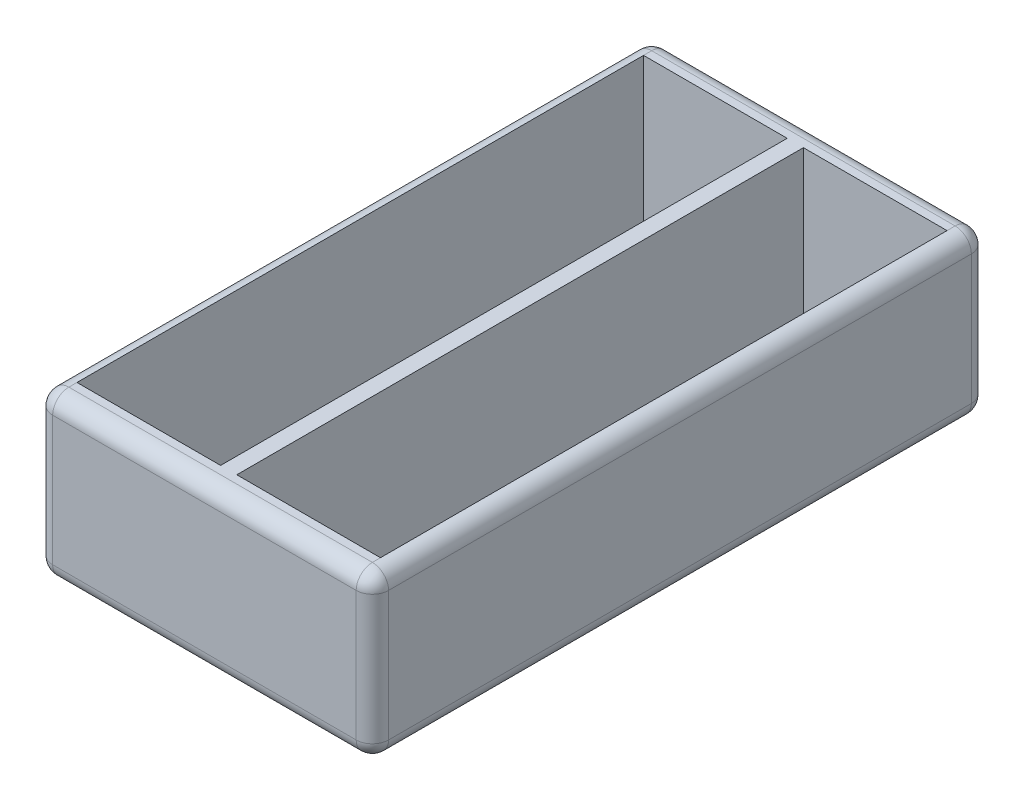
ISO-10303-21;
HEADER;
FILE_DESCRIPTION(('STEP AP214'),'2;1');
FILE_NAME('part.step','',(''),(''),'','','');
FILE_SCHEMA(('AUTOMOTIVE_DESIGN { 1 0 10303 214 1 1 1 1 }'));
ENDSEC;
DATA;
#1=APPLICATION_CONTEXT('core data for automotive mechanical design processes');
#2=APPLICATION_PROTOCOL_DEFINITION('international standard','automotive_design',2000,#1);
#3=PRODUCT_CONTEXT('',#1,'mechanical');
#4=PRODUCT('Part','Part','',(#3));
#5=PRODUCT_RELATED_PRODUCT_CATEGORY('part','',(#4));
#6=PRODUCT_DEFINITION_FORMATION('','',#4);
#7=PRODUCT_DEFINITION_CONTEXT('part definition',#1,'design');
#8=PRODUCT_DEFINITION('design','',#6,#7);
#9=PRODUCT_DEFINITION_SHAPE('','',#8);
#10=(LENGTH_UNIT() NAMED_UNIT(*) SI_UNIT(.MILLI.,.METRE.));
#11=(NAMED_UNIT(*) PLANE_ANGLE_UNIT() SI_UNIT($,.RADIAN.));
#12=(NAMED_UNIT(*) SI_UNIT($,.STERADIAN.) SOLID_ANGLE_UNIT());
#13=UNCERTAINTY_MEASURE_WITH_UNIT(LENGTH_MEASURE(1.E-05),#10,'distance_accuracy_value','');
#14=(GEOMETRIC_REPRESENTATION_CONTEXT(3) GLOBAL_UNCERTAINTY_ASSIGNED_CONTEXT((#13)) GLOBAL_UNIT_ASSIGNED_CONTEXT((#10,
#11,#12)) REPRESENTATION_CONTEXT('',''));
#15=CARTESIAN_POINT('',(0.,0.,0.));
#16=DIRECTION('',(0.,0.,1.));
#17=DIRECTION('',(1.,0.,0.));
#18=AXIS2_PLACEMENT_3D('',#15,#16,#17);
#19=CARTESIAN_POINT('',(20.75,20.,38.));
#20=DIRECTION('',(-1.,0.,0.));
#21=DIRECTION('',(0.,0.,1.));
#22=AXIS2_PLACEMENT_3D('',#19,#20,#21);
#23=PLANE('',#22);
#24=DIRECTION('',(0.,0.,-1.));
#25=VECTOR('',#24,1.);
#26=CARTESIAN_POINT('',(20.75,2.,-38.));
#27=LINE('',#26,#25);
#28=CARTESIAN_POINT('',(20.75,2.,36.));
#29=VERTEX_POINT('',#28);
#30=CARTESIAN_POINT('',(20.75,2.,-36.));
#31=VERTEX_POINT('',#30);
#32=EDGE_CURVE('E64',#29,#31,#27,.T.);
#33=ORIENTED_EDGE('',*,*,#32,.T.);
#34=DIRECTION('',(0.,-1.,0.));
#35=VECTOR('',#34,1.);
#36=CARTESIAN_POINT('',(20.75,20.,-36.));
#37=LINE('',#36,#35);
#38=CARTESIAN_POINT('',(20.75,18.,-36.));
#39=VERTEX_POINT('',#38);
#40=EDGE_CURVE('E11',#31,#39,#37,.F.);
#41=ORIENTED_EDGE('',*,*,#40,.T.);
#42=DIRECTION('',(0.,0.,-1.));
#43=VECTOR('',#42,1.);
#44=CARTESIAN_POINT('',(20.75,18.,38.));
#45=LINE('',#44,#43);
#46=CARTESIAN_POINT('',(20.75,18.,36.));
#47=VERTEX_POINT('',#46);
#48=EDGE_CURVE('E49',#39,#47,#45,.F.);
#49=ORIENTED_EDGE('',*,*,#48,.T.);
#50=DIRECTION('',(0.,-1.,0.));
#51=VECTOR('',#50,1.);
#52=CARTESIAN_POINT('',(20.75,20.,36.));
#53=LINE('',#52,#51);
#54=EDGE_CURVE('E355',#47,#29,#53,.T.);
#55=ORIENTED_EDGE('',*,*,#54,.T.);
#56=EDGE_LOOP('',(#33,#41,#49,#55));
#57=FACE_BOUND('',#56,.T.);
#58=ADVANCED_FACE('F39',(#57),#23,.F.);
#59=CARTESIAN_POINT('',(-20.75,20.,-38.));
#60=DIRECTION('',(0.,0.,1.));
#61=DIRECTION('',(1.,0.,0.));
#62=AXIS2_PLACEMENT_3D('',#59,#60,#61);
#63=PLANE('',#62);
#64=DIRECTION('',(-1.,0.,0.));
#65=VECTOR('',#64,1.);
#66=CARTESIAN_POINT('',(-20.75,18.,-38.));
#67=LINE('',#66,#65);
#68=CARTESIAN_POINT('',(-18.75,18.,-38.));
#69=VERTEX_POINT('',#68);
#70=CARTESIAN_POINT('',(18.75,18.,-38.));
#71=VERTEX_POINT('',#70);
#72=EDGE_CURVE('E348',#69,#71,#67,.F.);
#73=ORIENTED_EDGE('',*,*,#72,.T.);
#74=DIRECTION('',(0.,-1.,0.));
#75=VECTOR('',#74,1.);
#76=CARTESIAN_POINT('',(18.75,20.,-38.));
#77=LINE('',#76,#75);
#78=CARTESIAN_POINT('',(18.75,2.,-38.));
#79=VERTEX_POINT('',#78);
#80=EDGE_CURVE('E351',#71,#79,#77,.T.);
#81=ORIENTED_EDGE('',*,*,#80,.T.);
#82=DIRECTION('',(-1.,0.,0.));
#83=VECTOR('',#82,1.);
#84=CARTESIAN_POINT('',(-20.75,2.,-38.));
#85=LINE('',#84,#83);
#86=CARTESIAN_POINT('',(-18.75,2.,-38.));
#87=VERTEX_POINT('',#86);
#88=EDGE_CURVE('E342',#79,#87,#85,.T.);
#89=ORIENTED_EDGE('',*,*,#88,.T.);
#90=DIRECTION('',(0.,-1.,0.));
#91=VECTOR('',#90,1.);
#92=CARTESIAN_POINT('',(-18.75,20.,-38.));
#93=LINE('',#92,#91);
#94=EDGE_CURVE('E345',#87,#69,#93,.F.);
#95=ORIENTED_EDGE('',*,*,#94,.T.);
#96=EDGE_LOOP('',(#73,#81,#89,#95));
#97=FACE_BOUND('',#96,.T.);
#98=ADVANCED_FACE('F495',(#97),#63,.F.);
#99=CARTESIAN_POINT('',(-20.75,20.,38.));
#100=DIRECTION('',(1.,0.,0.));
#101=DIRECTION('',(0.,0.,-1.));
#102=AXIS2_PLACEMENT_3D('',#99,#100,#101);
#103=PLANE('',#102);
#104=DIRECTION('',(0.,-1.,0.));
#105=VECTOR('',#104,1.);
#106=CARTESIAN_POINT('',(-20.75,20.,36.));
#107=LINE('',#106,#105);
#108=CARTESIAN_POINT('',(-20.75,2.,36.));
#109=VERTEX_POINT('',#108);
#110=CARTESIAN_POINT('',(-20.75,18.,36.));
#111=VERTEX_POINT('',#110);
#112=EDGE_CURVE('E309',#109,#111,#107,.F.);
#113=ORIENTED_EDGE('',*,*,#112,.T.);
#114=DIRECTION('',(0.,0.,1.));
#115=VECTOR('',#114,1.);
#116=CARTESIAN_POINT('',(-20.75,18.,38.));
#117=LINE('',#116,#115);
#118=CARTESIAN_POINT('',(-20.75,18.,-36.));
#119=VERTEX_POINT('',#118);
#120=EDGE_CURVE('E312',#111,#119,#117,.F.);
#121=ORIENTED_EDGE('',*,*,#120,.T.);
#122=DIRECTION('',(0.,-1.,0.));
#123=VECTOR('',#122,1.);
#124=CARTESIAN_POINT('',(-20.75,20.,-36.));
#125=LINE('',#124,#123);
#126=CARTESIAN_POINT('',(-20.75,2.,-36.));
#127=VERTEX_POINT('',#126);
#128=EDGE_CURVE('E303',#119,#127,#125,.T.);
#129=ORIENTED_EDGE('',*,*,#128,.T.);
#130=DIRECTION('',(0.,0.,1.));
#131=VECTOR('',#130,1.);
#132=CARTESIAN_POINT('',(-20.75,2.,38.));
#133=LINE('',#132,#131);
#134=EDGE_CURVE('E306',#127,#109,#133,.T.);
#135=ORIENTED_EDGE('',*,*,#134,.T.);
#136=EDGE_LOOP('',(#113,#121,#129,#135));
#137=FACE_BOUND('',#136,.T.);
#138=ADVANCED_FACE('F500',(#137),#103,.F.);
#139=CARTESIAN_POINT('',(-20.75,20.,38.));
#140=DIRECTION('',(0.,0.,-1.));
#141=DIRECTION('',(-1.,0.,0.));
#142=AXIS2_PLACEMENT_3D('',#139,#140,#141);
#143=PLANE('',#142);
#144=DIRECTION('',(1.,0.,0.));
#145=VECTOR('',#144,1.);
#146=CARTESIAN_POINT('',(-20.75,18.,38.));
#147=LINE('',#146,#145);
#148=CARTESIAN_POINT('',(18.75,18.,38.));
#149=VERTEX_POINT('',#148);
#150=CARTESIAN_POINT('',(-18.75,18.,38.));
#151=VERTEX_POINT('',#150);
#152=EDGE_CURVE('E316',#149,#151,#147,.F.);
#153=ORIENTED_EDGE('',*,*,#152,.T.);
#154=DIRECTION('',(0.,-1.,0.));
#155=VECTOR('',#154,1.);
#156=CARTESIAN_POINT('',(-18.75,20.,38.));
#157=LINE('',#156,#155);
#158=CARTESIAN_POINT('',(-18.75,2.,38.));
#159=VERTEX_POINT('',#158);
#160=EDGE_CURVE('E325',#151,#159,#157,.T.);
#161=ORIENTED_EDGE('',*,*,#160,.T.);
#162=DIRECTION('',(1.,0.,0.));
#163=VECTOR('',#162,1.);
#164=CARTESIAN_POINT('',(20.75,2.,38.));
#165=LINE('',#164,#163);
#166=CARTESIAN_POINT('',(18.75,2.,38.));
#167=VERTEX_POINT('',#166);
#168=EDGE_CURVE('E322',#159,#167,#165,.T.);
#169=ORIENTED_EDGE('',*,*,#168,.T.);
#170=DIRECTION('',(0.,-1.,0.));
#171=VECTOR('',#170,1.);
#172=CARTESIAN_POINT('',(18.75,20.,38.));
#173=LINE('',#172,#171);
#174=EDGE_CURVE('E319',#167,#149,#173,.F.);
#175=ORIENTED_EDGE('',*,*,#174,.T.);
#176=EDGE_LOOP('',(#153,#161,#169,#175));
#177=FACE_BOUND('',#176,.T.);
#178=ADVANCED_FACE('F489',(#177),#143,.F.);
#179=CARTESIAN_POINT('',(0.,20.,0.));
#180=DIRECTION('',(0.,-1.,0.));
#181=DIRECTION('',(0.,0.,-1.));
#182=AXIS2_PLACEMENT_3D('',#179,#180,#181);
#183=PLANE('',#182);
#184=DIRECTION('',(-1.,0.,0.));
#185=VECTOR('',#184,1.);
#186=CARTESIAN_POINT('',(0.,20.,-36.));
#187=LINE('',#186,#185);
#188=CARTESIAN_POINT('',(18.75,20.,-36.));
#189=VERTEX_POINT('',#188);
#190=CARTESIAN_POINT('',(-18.75,20.,-36.));
#191=VERTEX_POINT('',#190);
#192=EDGE_CURVE('E296',#189,#191,#187,.T.);
#193=ORIENTED_EDGE('',*,*,#192,.T.);
#194=DIRECTION('',(0.,0.,1.));
#195=VECTOR('',#194,1.);
#196=CARTESIAN_POINT('',(-18.75,20.,0.));
#197=LINE('',#196,#195);
#198=CARTESIAN_POINT('',(-18.75,20.,-35.));
#199=VERTEX_POINT('',#198);
#200=EDGE_CURVE('E299',#191,#199,#197,.T.);
#201=ORIENTED_EDGE('',*,*,#200,.T.);
#202=DIRECTION('',(-1.,0.,0.));
#203=VECTOR('',#202,1.);
#204=CARTESIAN_POINT('',(-0.999999999999999,20.,-35.));
#205=LINE('',#204,#203);
#206=CARTESIAN_POINT('',(-0.999999999999999,20.,-35.));
#207=VERTEX_POINT('',#206);
#208=EDGE_CURVE('E225',#207,#199,#205,.T.);
#209=ORIENTED_EDGE('',*,*,#208,.F.);
#210=DIRECTION('',(0.,0.,-1.));
#211=VECTOR('',#210,1.);
#212=CARTESIAN_POINT('',(-0.999999999999999,20.,-35.));
#213=LINE('',#212,#211);
#214=CARTESIAN_POINT('',(-0.99999999999999,20.,35.));
#215=VERTEX_POINT('',#214);
#216=EDGE_CURVE('E188',#215,#207,#213,.T.);
#217=ORIENTED_EDGE('',*,*,#216,.F.);
#218=DIRECTION('',(1.,0.,0.));
#219=VECTOR('',#218,1.);
#220=CARTESIAN_POINT('',(-0.99999999999999,20.,35.));
#221=LINE('',#220,#219);
#222=CARTESIAN_POINT('',(-18.75,20.,35.));
#223=VERTEX_POINT('',#222);
#224=EDGE_CURVE('E209',#223,#215,#221,.T.);
#225=ORIENTED_EDGE('',*,*,#224,.F.);
#226=DIRECTION('',(0.,0.,1.));
#227=VECTOR('',#226,1.);
#228=CARTESIAN_POINT('',(-18.75,20.,0.));
#229=LINE('',#228,#227);
#230=CARTESIAN_POINT('',(-18.75,20.,36.));
#231=VERTEX_POINT('',#230);
#232=EDGE_CURVE('E290',#223,#231,#229,.T.);
#233=ORIENTED_EDGE('',*,*,#232,.T.);
#234=DIRECTION('',(1.,0.,0.));
#235=VECTOR('',#234,1.);
#236=CARTESIAN_POINT('',(0.,20.,36.));
#237=LINE('',#236,#235);
#238=CARTESIAN_POINT('',(18.75,20.,36.));
#239=VERTEX_POINT('',#238);
#240=EDGE_CURVE('E235',#231,#239,#237,.T.);
#241=ORIENTED_EDGE('',*,*,#240,.T.);
#242=DIRECTION('',(0.,0.,-1.));
#243=VECTOR('',#242,1.);
#244=CARTESIAN_POINT('',(18.75,20.,0.));
#245=LINE('',#244,#243);
#246=CARTESIAN_POINT('',(18.75,20.,35.));
#247=VERTEX_POINT('',#246);
#248=EDGE_CURVE('E287',#239,#247,#245,.T.);
#249=ORIENTED_EDGE('',*,*,#248,.T.);
#250=DIRECTION('',(1.,0.,0.));
#251=VECTOR('',#250,1.);
#252=CARTESIAN_POINT('',(0.99999999999999,20.,35.));
#253=LINE('',#252,#251);
#254=CARTESIAN_POINT('',(0.99999999999999,20.,35.));
#255=VERTEX_POINT('',#254);
#256=EDGE_CURVE('E266',#255,#247,#253,.T.);
#257=ORIENTED_EDGE('',*,*,#256,.F.);
#258=DIRECTION('',(0.,0.,1.));
#259=VECTOR('',#258,1.);
#260=CARTESIAN_POINT('',(0.999999999999999,20.,-35.));
#261=LINE('',#260,#259);
#262=CARTESIAN_POINT('',(0.999999999999999,20.,-35.));
#263=VERTEX_POINT('',#262);
#264=EDGE_CURVE('E262',#263,#255,#261,.T.);
#265=ORIENTED_EDGE('',*,*,#264,.F.);
#266=DIRECTION('',(-1.,0.,0.));
#267=VECTOR('',#266,1.);
#268=CARTESIAN_POINT('',(0.999999999999999,20.,-35.));
#269=LINE('',#268,#267);
#270=CARTESIAN_POINT('',(18.75,20.,-35.));
#271=VERTEX_POINT('',#270);
#272=EDGE_CURVE('E259',#271,#263,#269,.T.);
#273=ORIENTED_EDGE('',*,*,#272,.F.);
#274=DIRECTION('',(0.,0.,-1.));
#275=VECTOR('',#274,1.);
#276=CARTESIAN_POINT('',(18.75,20.,0.));
#277=LINE('',#276,#275);
#278=EDGE_CURVE('E293',#271,#189,#277,.T.);
#279=ORIENTED_EDGE('',*,*,#278,.T.);
#280=EDGE_LOOP('',(#193,#201,#209,#217,#225,#233,#241,#249,#257,#265,#273,#279));
#281=FACE_BOUND('',#280,.T.);
#282=ADVANCED_FACE('F479',(#281),#183,.F.);
#283=CARTESIAN_POINT('',(0.,0.,0.));
#284=DIRECTION('',(0.,-1.,0.));
#285=DIRECTION('',(0.,0.,-1.));
#286=AXIS2_PLACEMENT_3D('',#283,#284,#285);
#287=PLANE('',#286);
#288=DIRECTION('',(1.,0.,0.));
#289=VECTOR('',#288,1.);
#290=CARTESIAN_POINT('',(-20.75,0.,36.));
#291=LINE('',#290,#289);
#292=CARTESIAN_POINT('',(18.75,0.,36.));
#293=VERTEX_POINT('',#292);
#294=CARTESIAN_POINT('',(-18.75,0.,36.));
#295=VERTEX_POINT('',#294);
#296=EDGE_CURVE('E329',#293,#295,#291,.F.);
#297=ORIENTED_EDGE('',*,*,#296,.T.);
#298=DIRECTION('',(0.,0.,1.));
#299=VECTOR('',#298,1.);
#300=CARTESIAN_POINT('',(-18.75,0.,-38.));
#301=LINE('',#300,#299);
#302=CARTESIAN_POINT('',(-18.75,0.,-36.));
#303=VERTEX_POINT('',#302);
#304=EDGE_CURVE('E338',#295,#303,#301,.F.);
#305=ORIENTED_EDGE('',*,*,#304,.T.);
#306=DIRECTION('',(-1.,0.,0.));
#307=VECTOR('',#306,1.);
#308=CARTESIAN_POINT('',(20.75,0.,-36.));
#309=LINE('',#308,#307);
#310=CARTESIAN_POINT('',(18.75,0.,-36.));
#311=VERTEX_POINT('',#310);
#312=EDGE_CURVE('E335',#303,#311,#309,.F.);
#313=ORIENTED_EDGE('',*,*,#312,.T.);
#314=DIRECTION('',(0.,0.,-1.));
#315=VECTOR('',#314,1.);
#316=CARTESIAN_POINT('',(18.75,0.,38.));
#317=LINE('',#316,#315);
#318=EDGE_CURVE('E332',#311,#293,#317,.F.);
#319=ORIENTED_EDGE('',*,*,#318,.T.);
#320=EDGE_LOOP('',(#297,#305,#313,#319));
#321=FACE_BOUND('',#320,.T.);
#322=CARTESIAN_POINT('',(-8.85,0.,0.));
#323=DIRECTION('',(0.,-1.,0.));
#324=DIRECTION('',(0.,0.,-1.));
#325=AXIS2_PLACEMENT_3D('',#322,#323,#324);
#326=CIRCLE('',#325,1.6);
#327=CARTESIAN_POINT('',(-8.85,0.,-1.6));
#328=VERTEX_POINT('',#327);
#329=EDGE_CURVE('E464',#328,#328,#326,.T.);
#330=ORIENTED_EDGE('',*,*,#329,.F.);
#331=EDGE_LOOP('',(#330));
#332=FACE_BOUND('',#331,.T.);
#333=CARTESIAN_POINT('',(8.85,0.,0.));
#334=DIRECTION('',(0.,-1.,0.));
#335=DIRECTION('',(0.,0.,-1.));
#336=AXIS2_PLACEMENT_3D('',#333,#334,#335);
#337=CIRCLE('',#336,1.6);
#338=CARTESIAN_POINT('',(8.85,0.,-1.6));
#339=VERTEX_POINT('',#338);
#340=EDGE_CURVE('E216',#339,#339,#337,.T.);
#341=ORIENTED_EDGE('',*,*,#340,.F.);
#342=EDGE_LOOP('',(#341));
#343=FACE_BOUND('',#342,.T.);
#344=ADVANCED_FACE('F476',(#321,#332,#343),#287,.T.);
#345=CARTESIAN_POINT('',(0.999999999999999,1.,-35.));
#346=DIRECTION('',(0.,0.,-1.));
#347=DIRECTION('',(-1.,0.,0.));
#348=AXIS2_PLACEMENT_3D('',#345,#346,#347);
#349=PLANE('',#348);
#350=ORIENTED_EDGE('',*,*,#272,.T.);
#351=DIRECTION('',(0.,1.,0.));
#352=VECTOR('',#351,1.);
#353=CARTESIAN_POINT('',(0.999999999999999,1.,-35.));
#354=LINE('',#353,#352);
#355=CARTESIAN_POINT('',(0.999999999999999,1.,-35.));
#356=VERTEX_POINT('',#355);
#357=EDGE_CURVE('E258',#356,#263,#354,.T.);
#358=ORIENTED_EDGE('',*,*,#357,.F.);
#359=DIRECTION('',(-1.,0.,0.));
#360=VECTOR('',#359,1.);
#361=CARTESIAN_POINT('',(0.999999999999999,1.,-35.));
#362=LINE('',#361,#360);
#363=CARTESIAN_POINT('',(18.75,1.,-35.));
#364=VERTEX_POINT('',#363);
#365=EDGE_CURVE('E241',#364,#356,#362,.T.);
#366=ORIENTED_EDGE('',*,*,#365,.F.);
#367=DIRECTION('',(0.,1.,0.));
#368=VECTOR('',#367,1.);
#369=CARTESIAN_POINT('',(18.75,1.,-35.));
#370=LINE('',#369,#368);
#371=EDGE_CURVE('E226',#364,#271,#370,.T.);
#372=ORIENTED_EDGE('',*,*,#371,.T.);
#373=EDGE_LOOP('',(#350,#358,#366,#372));
#374=FACE_BOUND('',#373,.T.);
#375=ADVANCED_FACE('F478',(#374),#349,.F.);
#376=CARTESIAN_POINT('',(18.75,1.,-35.));
#377=DIRECTION('',(1.,0.,0.));
#378=DIRECTION('',(0.,0.,-1.));
#379=AXIS2_PLACEMENT_3D('',#376,#377,#378);
#380=PLANE('',#379);
#381=DIRECTION('',(0.,0.,-1.));
#382=VECTOR('',#381,1.);
#383=CARTESIAN_POINT('',(18.75,20.,-35.));
#384=LINE('',#383,#382);
#385=EDGE_CURVE('E246',#247,#271,#384,.T.);
#386=ORIENTED_EDGE('',*,*,#385,.T.);
#387=ORIENTED_EDGE('',*,*,#371,.F.);
#388=DIRECTION('',(0.,0.,-1.));
#389=VECTOR('',#388,1.);
#390=CARTESIAN_POINT('',(18.75,1.,-35.));
#391=LINE('',#390,#389);
#392=CARTESIAN_POINT('',(18.75,1.,35.));
#393=VERTEX_POINT('',#392);
#394=EDGE_CURVE('E254',#393,#364,#391,.T.);
#395=ORIENTED_EDGE('',*,*,#394,.F.);
#396=DIRECTION('',(0.,1.,0.));
#397=VECTOR('',#396,1.);
#398=CARTESIAN_POINT('',(18.75,1.,35.));
#399=LINE('',#398,#397);
#400=EDGE_CURVE('E275',#393,#247,#399,.T.);
#401=ORIENTED_EDGE('',*,*,#400,.T.);
#402=EDGE_LOOP('',(#386,#387,#395,#401));
#403=FACE_BOUND('',#402,.T.);
#404=ADVANCED_FACE('F486',(#403),#380,.F.);
#405=CARTESIAN_POINT('',(0.99999999999999,1.,35.));
#406=DIRECTION('',(0.,0.,1.));
#407=DIRECTION('',(1.,0.,0.));
#408=AXIS2_PLACEMENT_3D('',#405,#406,#407);
#409=PLANE('',#408);
#410=ORIENTED_EDGE('',*,*,#256,.T.);
#411=ORIENTED_EDGE('',*,*,#400,.F.);
#412=DIRECTION('',(1.,0.,0.));
#413=VECTOR('',#412,1.);
#414=CARTESIAN_POINT('',(0.99999999999999,1.,35.));
#415=LINE('',#414,#413);
#416=CARTESIAN_POINT('',(0.99999999999999,1.,35.));
#417=VERTEX_POINT('',#416);
#418=EDGE_CURVE('E250',#417,#393,#415,.T.);
#419=ORIENTED_EDGE('',*,*,#418,.F.);
#420=DIRECTION('',(0.,1.,0.));
#421=VECTOR('',#420,1.);
#422=CARTESIAN_POINT('',(0.99999999999999,1.,35.));
#423=LINE('',#422,#421);
#424=EDGE_CURVE('E279',#417,#255,#423,.T.);
#425=ORIENTED_EDGE('',*,*,#424,.T.);
#426=EDGE_LOOP('',(#410,#411,#419,#425));
#427=FACE_BOUND('',#426,.T.);
#428=ADVANCED_FACE('F626',(#427),#409,.F.);
#429=CARTESIAN_POINT('',(0.999999999999999,1.,-35.));
#430=DIRECTION('',(-1.,0.,0.));
#431=DIRECTION('',(0.,0.,1.));
#432=AXIS2_PLACEMENT_3D('',#429,#430,#431);
#433=PLANE('',#432);
#434=ORIENTED_EDGE('',*,*,#264,.T.);
#435=ORIENTED_EDGE('',*,*,#424,.F.);
#436=DIRECTION('',(0.,0.,1.));
#437=VECTOR('',#436,1.);
#438=CARTESIAN_POINT('',(0.999999999999999,1.,-35.));
#439=LINE('',#438,#437);
#440=EDGE_CURVE('E245',#356,#417,#439,.T.);
#441=ORIENTED_EDGE('',*,*,#440,.F.);
#442=ORIENTED_EDGE('',*,*,#357,.T.);
#443=EDGE_LOOP('',(#434,#435,#441,#442));
#444=FACE_BOUND('',#443,.T.);
#445=ADVANCED_FACE('F652',(#444),#433,.F.);
#446=CARTESIAN_POINT('',(0.,1.,0.));
#447=DIRECTION('',(0.,-1.,0.));
#448=DIRECTION('',(0.,0.,-1.));
#449=AXIS2_PLACEMENT_3D('',#446,#447,#448);
#450=PLANE('',#449);
#451=CARTESIAN_POINT('',(8.85,1.,0.));
#452=DIRECTION('',(0.,1.,0.));
#453=DIRECTION('',(0.,0.,-1.));
#454=AXIS2_PLACEMENT_3D('',#451,#452,#453);
#455=CIRCLE('',#454,1.6);
#456=CARTESIAN_POINT('',(8.85,1.,-1.6));
#457=VERTEX_POINT('',#456);
#458=EDGE_CURVE('E452',#457,#457,#455,.T.);
#459=ORIENTED_EDGE('',*,*,#458,.F.);
#460=EDGE_LOOP('',(#459));
#461=FACE_BOUND('',#460,.T.);
#462=ORIENTED_EDGE('',*,*,#365,.T.);
#463=ORIENTED_EDGE('',*,*,#440,.T.);
#464=ORIENTED_EDGE('',*,*,#418,.T.);
#465=ORIENTED_EDGE('',*,*,#394,.T.);
#466=EDGE_LOOP('',(#462,#463,#464,#465));
#467=FACE_BOUND('',#466,.T.);
#468=ADVANCED_FACE('F643',(#461,#467),#450,.F.);
#469=CARTESIAN_POINT('',(-0.999999999999999,1.,-35.));
#470=DIRECTION('',(1.,0.,0.));
#471=DIRECTION('',(0.,0.,-1.));
#472=AXIS2_PLACEMENT_3D('',#469,#470,#471);
#473=PLANE('',#472);
#474=ORIENTED_EDGE('',*,*,#216,.T.);
#475=DIRECTION('',(0.,1.,0.));
#476=VECTOR('',#475,1.);
#477=CARTESIAN_POINT('',(-0.999999999999999,1.,-35.));
#478=LINE('',#477,#476);
#479=CARTESIAN_POINT('',(-0.999999999999999,1.,-35.));
#480=VERTEX_POINT('',#479);
#481=EDGE_CURVE('E181',#480,#207,#478,.T.);
#482=ORIENTED_EDGE('',*,*,#481,.F.);
#483=DIRECTION('',(0.,0.,-1.));
#484=VECTOR('',#483,1.);
#485=CARTESIAN_POINT('',(-0.999999999999999,1.,-35.));
#486=LINE('',#485,#484);
#487=CARTESIAN_POINT('',(-0.99999999999999,1.,35.));
#488=VERTEX_POINT('',#487);
#489=EDGE_CURVE('E185',#488,#480,#486,.T.);
#490=ORIENTED_EDGE('',*,*,#489,.F.);
#491=DIRECTION('',(0.,1.,0.));
#492=VECTOR('',#491,1.);
#493=CARTESIAN_POINT('',(-0.99999999999999,1.,35.));
#494=LINE('',#493,#492);
#495=EDGE_CURVE('E232',#488,#215,#494,.T.);
#496=ORIENTED_EDGE('',*,*,#495,.T.);
#497=EDGE_LOOP('',(#474,#482,#490,#496));
#498=FACE_BOUND('',#497,.T.);
#499=ADVANCED_FACE('F183',(#498),#473,.F.);
#500=CARTESIAN_POINT('',(-0.99999999999999,1.,35.));
#501=DIRECTION('',(0.,0.,1.));
#502=DIRECTION('',(1.,0.,0.));
#503=AXIS2_PLACEMENT_3D('',#500,#501,#502);
#504=PLANE('',#503);
#505=ORIENTED_EDGE('',*,*,#224,.T.);
#506=ORIENTED_EDGE('',*,*,#495,.F.);
#507=DIRECTION('',(1.,0.,0.));
#508=VECTOR('',#507,1.);
#509=CARTESIAN_POINT('',(-0.99999999999999,1.,35.));
#510=LINE('',#509,#508);
#511=CARTESIAN_POINT('',(-18.75,1.,35.));
#512=VERTEX_POINT('',#511);
#513=EDGE_CURVE('E194',#512,#488,#510,.T.);
#514=ORIENTED_EDGE('',*,*,#513,.F.);
#515=DIRECTION('',(0.,1.,0.));
#516=VECTOR('',#515,1.);
#517=CARTESIAN_POINT('',(-18.75,1.,35.));
#518=LINE('',#517,#516);
#519=EDGE_CURVE('E236',#512,#223,#518,.T.);
#520=ORIENTED_EDGE('',*,*,#519,.T.);
#521=EDGE_LOOP('',(#505,#506,#514,#520));
#522=FACE_BOUND('',#521,.T.);
#523=ADVANCED_FACE('F635',(#522),#504,.F.);
#524=CARTESIAN_POINT('',(-18.75,1.,-35.));
#525=DIRECTION('',(-1.,0.,0.));
#526=DIRECTION('',(0.,0.,1.));
#527=AXIS2_PLACEMENT_3D('',#524,#525,#526);
#528=PLANE('',#527);
#529=DIRECTION('',(0.,0.,1.));
#530=VECTOR('',#529,1.);
#531=CARTESIAN_POINT('',(-18.75,20.,-35.));
#532=LINE('',#531,#530);
#533=EDGE_CURVE('E213',#199,#223,#532,.T.);
#534=ORIENTED_EDGE('',*,*,#533,.T.);
#535=ORIENTED_EDGE('',*,*,#519,.F.);
#536=DIRECTION('',(0.,0.,1.));
#537=VECTOR('',#536,1.);
#538=CARTESIAN_POINT('',(-18.75,1.,-35.));
#539=LINE('',#538,#537);
#540=CARTESIAN_POINT('',(-18.75,1.,-35.));
#541=VERTEX_POINT('',#540);
#542=EDGE_CURVE('E204',#541,#512,#539,.T.);
#543=ORIENTED_EDGE('',*,*,#542,.F.);
#544=DIRECTION('',(0.,1.,0.));
#545=VECTOR('',#544,1.);
#546=CARTESIAN_POINT('',(-18.75,1.,-35.));
#547=LINE('',#546,#545);
#548=EDGE_CURVE('E193',#541,#199,#547,.T.);
#549=ORIENTED_EDGE('',*,*,#548,.T.);
#550=EDGE_LOOP('',(#534,#535,#543,#549));
#551=FACE_BOUND('',#550,.T.);
#552=ADVANCED_FACE('F633',(#551),#528,.F.);
#553=CARTESIAN_POINT('',(-0.999999999999999,1.,-35.));
#554=DIRECTION('',(0.,0.,-1.));
#555=DIRECTION('',(-1.,0.,0.));
#556=AXIS2_PLACEMENT_3D('',#553,#554,#555);
#557=PLANE('',#556);
#558=ORIENTED_EDGE('',*,*,#208,.T.);
#559=ORIENTED_EDGE('',*,*,#548,.F.);
#560=DIRECTION('',(-1.,0.,0.));
#561=VECTOR('',#560,1.);
#562=CARTESIAN_POINT('',(-0.999999999999999,1.,-35.));
#563=LINE('',#562,#561);
#564=EDGE_CURVE('E197',#480,#541,#563,.T.);
#565=ORIENTED_EDGE('',*,*,#564,.F.);
#566=ORIENTED_EDGE('',*,*,#481,.T.);
#567=EDGE_LOOP('',(#558,#559,#565,#566));
#568=FACE_BOUND('',#567,.T.);
#569=ADVANCED_FACE('F198',(#568),#557,.F.);
#570=CARTESIAN_POINT('',(0.,1.,0.));
#571=DIRECTION('',(0.,-1.,0.));
#572=DIRECTION('',(0.,0.,-1.));
#573=AXIS2_PLACEMENT_3D('',#570,#571,#572);
#574=PLANE('',#573);
#575=CARTESIAN_POINT('',(-8.85,1.,0.));
#576=DIRECTION('',(0.,1.,0.));
#577=DIRECTION('',(0.,0.,1.));
#578=AXIS2_PLACEMENT_3D('',#575,#576,#577);
#579=CIRCLE('',#578,1.6);
#580=CARTESIAN_POINT('',(-8.85,1.,1.6));
#581=VERTEX_POINT('',#580);
#582=EDGE_CURVE('E458',#581,#581,#579,.T.);
#583=ORIENTED_EDGE('',*,*,#582,.F.);
#584=EDGE_LOOP('',(#583));
#585=FACE_BOUND('',#584,.T.);
#586=ORIENTED_EDGE('',*,*,#489,.T.);
#587=ORIENTED_EDGE('',*,*,#564,.T.);
#588=ORIENTED_EDGE('',*,*,#542,.T.);
#589=ORIENTED_EDGE('',*,*,#513,.T.);
#590=EDGE_LOOP('',(#586,#587,#588,#589));
#591=FACE_BOUND('',#590,.T.);
#592=ADVANCED_FACE('F206',(#585,#591),#574,.F.);
#593=CARTESIAN_POINT('',(-8.85,-18.,0.));
#594=DIRECTION('',(0.,1.,0.));
#595=DIRECTION('',(0.,0.,1.));
#596=AXIS2_PLACEMENT_3D('',#593,#594,#595);
#597=CYLINDRICAL_SURFACE('',#596,1.6);
#598=ORIENTED_EDGE('',*,*,#329,.T.);
#599=EDGE_LOOP('',(#598));
#600=FACE_BOUND('',#599,.T.);
#601=ORIENTED_EDGE('',*,*,#582,.T.);
#602=EDGE_LOOP('',(#601));
#603=FACE_BOUND('',#602,.T.);
#604=ADVANCED_FACE('F701',(#600,#603),#597,.F.);
#605=CARTESIAN_POINT('',(8.85,-18.,0.));
#606=DIRECTION('',(0.,1.,0.));
#607=DIRECTION('',(0.,0.,1.));
#608=AXIS2_PLACEMENT_3D('',#605,#606,#607);
#609=CYLINDRICAL_SURFACE('',#608,1.6);
#610=ORIENTED_EDGE('',*,*,#340,.T.);
#611=EDGE_LOOP('',(#610));
#612=FACE_BOUND('',#611,.T.);
#613=ORIENTED_EDGE('',*,*,#458,.T.);
#614=EDGE_LOOP('',(#613));
#615=FACE_BOUND('',#614,.T.);
#616=ADVANCED_FACE('F474',(#612,#615),#609,.F.);
#617=CARTESIAN_POINT('',(18.75,2.,38.));
#618=DIRECTION('',(0.,0.,1.));
#619=DIRECTION('',(1.,0.,0.));
#620=AXIS2_PLACEMENT_3D('',#617,#618,#619);
#621=CYLINDRICAL_SURFACE('',#620,2.);
#622=CARTESIAN_POINT('',(18.75,2.,-36.));
#623=DIRECTION('',(0.,0.,-1.));
#624=DIRECTION('',(-1.,0.,0.));
#625=AXIS2_PLACEMENT_3D('',#622,#623,#624);
#626=CIRCLE('',#625,2.);
#627=EDGE_CURVE('E43',#31,#311,#626,.T.);
#628=ORIENTED_EDGE('',*,*,#627,.F.);
#629=ORIENTED_EDGE('',*,*,#32,.F.);
#630=CARTESIAN_POINT('',(18.75,2.,36.));
#631=DIRECTION('',(0.,0.,1.));
#632=DIRECTION('',(1.,0.,0.));
#633=AXIS2_PLACEMENT_3D('',#630,#631,#632);
#634=CIRCLE('',#633,2.);
#635=EDGE_CURVE('E443',#293,#29,#634,.T.);
#636=ORIENTED_EDGE('',*,*,#635,.F.);
#637=ORIENTED_EDGE('',*,*,#318,.F.);
#638=EDGE_LOOP('',(#628,#629,#636,#637));
#639=FACE_BOUND('',#638,.T.);
#640=ADVANCED_FACE('F41',(#639),#621,.T.);
#641=CARTESIAN_POINT('',(18.75,2.,-36.));
#642=DIRECTION('',(0.,-1.,0.));
#643=DIRECTION('',(0.,0.,-1.));
#644=AXIS2_PLACEMENT_3D('',#641,#642,#643);
#645=SPHERICAL_SURFACE('',#644,2.);
#646=CARTESIAN_POINT('',(18.75,2.,-36.));
#647=DIRECTION('',(0.,-1.,0.));
#648=DIRECTION('',(0.,0.,-1.));
#649=AXIS2_PLACEMENT_3D('',#646,#647,#648);
#650=CIRCLE('',#649,2.);
#651=EDGE_CURVE('E436',#31,#79,#650,.F.);
#652=ORIENTED_EDGE('',*,*,#651,.F.);
#653=ORIENTED_EDGE('',*,*,#627,.T.);
#654=CARTESIAN_POINT('',(18.75,2.,-36.));
#655=DIRECTION('',(1.,0.,0.));
#656=DIRECTION('',(0.,0.,-1.));
#657=AXIS2_PLACEMENT_3D('',#654,#655,#656);
#658=CIRCLE('',#657,2.);
#659=EDGE_CURVE('E440',#79,#311,#658,.F.);
#660=ORIENTED_EDGE('',*,*,#659,.F.);
#661=EDGE_LOOP('',(#652,#653,#660));
#662=FACE_BOUND('',#661,.T.);
#663=ADVANCED_FACE('F574',(#662),#645,.T.);
#664=CARTESIAN_POINT('',(18.75,2.,36.));
#665=DIRECTION('',(1.,0.,0.));
#666=DIRECTION('',(0.,1.,0.));
#667=AXIS2_PLACEMENT_3D('',#664,#665,#666);
#668=SPHERICAL_SURFACE('',#667,2.);
#669=CARTESIAN_POINT('',(18.75,2.,36.));
#670=DIRECTION('',(1.,0.,0.));
#671=DIRECTION('',(0.,0.,-1.));
#672=AXIS2_PLACEMENT_3D('',#669,#670,#671);
#673=CIRCLE('',#672,2.);
#674=EDGE_CURVE('E428',#293,#167,#673,.F.);
#675=ORIENTED_EDGE('',*,*,#674,.F.);
#676=ORIENTED_EDGE('',*,*,#635,.T.);
#677=CARTESIAN_POINT('',(18.75,2.,36.));
#678=DIRECTION('',(0.,-1.,0.));
#679=DIRECTION('',(0.,0.,-1.));
#680=AXIS2_PLACEMENT_3D('',#677,#678,#679);
#681=CIRCLE('',#680,2.);
#682=EDGE_CURVE('E432',#167,#29,#681,.F.);
#683=ORIENTED_EDGE('',*,*,#682,.F.);
#684=EDGE_LOOP('',(#675,#676,#683));
#685=FACE_BOUND('',#684,.T.);
#686=ADVANCED_FACE('F571',(#685),#668,.T.);
#687=CARTESIAN_POINT('',(-20.75,2.,-36.));
#688=DIRECTION('',(1.,0.,0.));
#689=DIRECTION('',(0.,0.,-1.));
#690=AXIS2_PLACEMENT_3D('',#687,#688,#689);
#691=CYLINDRICAL_SURFACE('',#690,2.);
#692=ORIENTED_EDGE('',*,*,#659,.T.);
#693=ORIENTED_EDGE('',*,*,#312,.F.);
#694=CARTESIAN_POINT('',(-18.75,2.,-36.));
#695=DIRECTION('',(-1.,0.,0.));
#696=DIRECTION('',(0.,0.,1.));
#697=AXIS2_PLACEMENT_3D('',#694,#695,#696);
#698=CIRCLE('',#697,2.);
#699=EDGE_CURVE('E421',#87,#303,#698,.T.);
#700=ORIENTED_EDGE('',*,*,#699,.F.);
#701=ORIENTED_EDGE('',*,*,#88,.F.);
#702=EDGE_LOOP('',(#692,#693,#700,#701));
#703=FACE_BOUND('',#702,.T.);
#704=ADVANCED_FACE('F567',(#703),#691,.T.);
#705=CARTESIAN_POINT('',(18.75,20.,-36.));
#706=DIRECTION('',(0.,-1.,0.));
#707=DIRECTION('',(0.,0.,-1.));
#708=AXIS2_PLACEMENT_3D('',#705,#706,#707);
#709=CYLINDRICAL_SURFACE('',#708,2.);
#710=ORIENTED_EDGE('',*,*,#651,.T.);
#711=ORIENTED_EDGE('',*,*,#80,.F.);
#712=CARTESIAN_POINT('',(18.75,18.,-36.));
#713=DIRECTION('',(0.,1.,0.));
#714=DIRECTION('',(0.,0.,1.));
#715=AXIS2_PLACEMENT_3D('',#712,#713,#714);
#716=CIRCLE('',#715,2.);
#717=EDGE_CURVE('E418',#39,#71,#716,.T.);
#718=ORIENTED_EDGE('',*,*,#717,.F.);
#719=ORIENTED_EDGE('',*,*,#40,.F.);
#720=EDGE_LOOP('',(#710,#711,#718,#719));
#721=FACE_BOUND('',#720,.T.);
#722=ADVANCED_FACE('F563',(#721),#709,.T.);
#723=CARTESIAN_POINT('',(18.75,18.,0.));
#724=DIRECTION('',(0.,0.,-1.));
#725=DIRECTION('',(-1.,0.,0.));
#726=AXIS2_PLACEMENT_3D('',#723,#724,#725);
#727=CYLINDRICAL_SURFACE('',#726,2.);
#728=CARTESIAN_POINT('',(18.75,18.,36.));
#729=DIRECTION('',(0.,0.,1.));
#730=DIRECTION('',(1.,0.,0.));
#731=AXIS2_PLACEMENT_3D('',#728,#729,#730);
#732=CIRCLE('',#731,2.);
#733=EDGE_CURVE('E412',#47,#239,#732,.T.);
#734=ORIENTED_EDGE('',*,*,#733,.F.);
#735=ORIENTED_EDGE('',*,*,#48,.F.);
#736=CARTESIAN_POINT('',(18.75,18.,-36.));
#737=DIRECTION('',(0.,0.,-1.));
#738=DIRECTION('',(-1.,0.,0.));
#739=AXIS2_PLACEMENT_3D('',#736,#737,#738);
#740=CIRCLE('',#739,2.);
#741=EDGE_CURVE('E57',#189,#39,#740,.T.);
#742=ORIENTED_EDGE('',*,*,#741,.F.);
#743=ORIENTED_EDGE('',*,*,#278,.F.);
#744=ORIENTED_EDGE('',*,*,#385,.F.);
#745=ORIENTED_EDGE('',*,*,#248,.F.);
#746=EDGE_LOOP('',(#734,#735,#742,#743,#744,#745));
#747=FACE_BOUND('',#746,.T.);
#748=ADVANCED_FACE('F559',(#747),#727,.T.);
#749=CARTESIAN_POINT('',(18.75,20.,36.));
#750=DIRECTION('',(0.,-1.,0.));
#751=DIRECTION('',(0.,0.,-1.));
#752=AXIS2_PLACEMENT_3D('',#749,#750,#751);
#753=CYLINDRICAL_SURFACE('',#752,2.);
#754=ORIENTED_EDGE('',*,*,#682,.T.);
#755=ORIENTED_EDGE('',*,*,#54,.F.);
#756=CARTESIAN_POINT('',(18.75,18.,36.));
#757=DIRECTION('',(0.,1.,0.));
#758=DIRECTION('',(0.,0.,1.));
#759=AXIS2_PLACEMENT_3D('',#756,#757,#758);
#760=CIRCLE('',#759,2.);
#761=EDGE_CURVE('E408',#149,#47,#760,.T.);
#762=ORIENTED_EDGE('',*,*,#761,.F.);
#763=ORIENTED_EDGE('',*,*,#174,.F.);
#764=EDGE_LOOP('',(#754,#755,#762,#763));
#765=FACE_BOUND('',#764,.T.);
#766=ADVANCED_FACE('F555',(#765),#753,.T.);
#767=CARTESIAN_POINT('',(-20.75,2.,36.));
#768=DIRECTION('',(-1.,0.,0.));
#769=DIRECTION('',(0.,0.,1.));
#770=AXIS2_PLACEMENT_3D('',#767,#768,#769);
#771=CYLINDRICAL_SURFACE('',#770,2.);
#772=ORIENTED_EDGE('',*,*,#674,.T.);
#773=ORIENTED_EDGE('',*,*,#168,.F.);
#774=CARTESIAN_POINT('',(-18.75,2.,36.));
#775=DIRECTION('',(-1.,0.,0.));
#776=DIRECTION('',(0.,0.,1.));
#777=AXIS2_PLACEMENT_3D('',#774,#775,#776);
#778=CIRCLE('',#777,2.);
#779=EDGE_CURVE('E404',#295,#159,#778,.T.);
#780=ORIENTED_EDGE('',*,*,#779,.F.);
#781=ORIENTED_EDGE('',*,*,#296,.F.);
#782=EDGE_LOOP('',(#772,#773,#780,#781));
#783=FACE_BOUND('',#782,.T.);
#784=ADVANCED_FACE('F551',(#783),#771,.T.);
#785=CARTESIAN_POINT('',(-18.75,2.,38.));
#786=DIRECTION('',(0.,0.,-1.));
#787=DIRECTION('',(-1.,0.,0.));
#788=AXIS2_PLACEMENT_3D('',#785,#786,#787);
#789=CYLINDRICAL_SURFACE('',#788,2.);
#790=CARTESIAN_POINT('',(-18.75,2.,-36.));
#791=DIRECTION('',(0.,0.,-1.));
#792=DIRECTION('',(-1.,0.,0.));
#793=AXIS2_PLACEMENT_3D('',#790,#791,#792);
#794=CIRCLE('',#793,2.);
#795=EDGE_CURVE('E424',#303,#127,#794,.T.);
#796=ORIENTED_EDGE('',*,*,#795,.F.);
#797=ORIENTED_EDGE('',*,*,#304,.F.);
#798=CARTESIAN_POINT('',(-18.75,2.,36.));
#799=DIRECTION('',(0.,0.,1.));
#800=DIRECTION('',(1.,0.,0.));
#801=AXIS2_PLACEMENT_3D('',#798,#799,#800);
#802=CIRCLE('',#801,2.);
#803=EDGE_CURVE('E400',#109,#295,#802,.T.);
#804=ORIENTED_EDGE('',*,*,#803,.F.);
#805=ORIENTED_EDGE('',*,*,#134,.F.);
#806=EDGE_LOOP('',(#796,#797,#804,#805));
#807=FACE_BOUND('',#806,.T.);
#808=ADVANCED_FACE('F547',(#807),#789,.T.);
#809=CARTESIAN_POINT('',(-18.75,2.,-36.));
#810=DIRECTION('',(0.,-1.,0.));
#811=DIRECTION('',(0.,0.,-1.));
#812=AXIS2_PLACEMENT_3D('',#809,#810,#811);
#813=SPHERICAL_SURFACE('',#812,2.);
#814=ORIENTED_EDGE('',*,*,#699,.T.);
#815=ORIENTED_EDGE('',*,*,#795,.T.);
#816=CARTESIAN_POINT('',(-18.75,2.,-36.));
#817=DIRECTION('',(0.,-1.,0.));
#818=DIRECTION('',(0.,0.,-1.));
#819=AXIS2_PLACEMENT_3D('',#816,#817,#818);
#820=CIRCLE('',#819,2.);
#821=EDGE_CURVE('E396',#87,#127,#820,.F.);
#822=ORIENTED_EDGE('',*,*,#821,.F.);
#823=EDGE_LOOP('',(#814,#815,#822));
#824=FACE_BOUND('',#823,.T.);
#825=ADVANCED_FACE('F544',(#824),#813,.T.);
#826=CARTESIAN_POINT('',(18.75,18.,-36.));
#827=DIRECTION('',(1.,0.,0.));
#828=DIRECTION('',(0.,0.,-1.));
#829=AXIS2_PLACEMENT_3D('',#826,#827,#828);
#830=SPHERICAL_SURFACE('',#829,2.);
#831=ORIENTED_EDGE('',*,*,#741,.T.);
#832=ORIENTED_EDGE('',*,*,#717,.T.);
#833=CARTESIAN_POINT('',(18.75,18.,-36.));
#834=DIRECTION('',(1.,0.,0.));
#835=DIRECTION('',(0.,1.,0.));
#836=AXIS2_PLACEMENT_3D('',#833,#834,#835);
#837=CIRCLE('',#836,2.);
#838=EDGE_CURVE('E392',#189,#71,#837,.F.);
#839=ORIENTED_EDGE('',*,*,#838,.F.);
#840=EDGE_LOOP('',(#831,#832,#839));
#841=FACE_BOUND('',#840,.T.);
#842=ADVANCED_FACE('F540',(#841),#830,.T.);
#843=CARTESIAN_POINT('',(18.75,18.,36.));
#844=DIRECTION('',(1.,0.,0.));
#845=DIRECTION('',(0.,0.,-1.));
#846=AXIS2_PLACEMENT_3D('',#843,#844,#845);
#847=SPHERICAL_SURFACE('',#846,2.);
#848=ORIENTED_EDGE('',*,*,#761,.T.);
#849=ORIENTED_EDGE('',*,*,#733,.T.);
#850=CARTESIAN_POINT('',(18.75,18.,36.));
#851=DIRECTION('',(1.,0.,0.));
#852=DIRECTION('',(0.,0.,-1.));
#853=AXIS2_PLACEMENT_3D('',#850,#851,#852);
#854=CIRCLE('',#853,2.);
#855=EDGE_CURVE('E388',#149,#239,#854,.F.);
#856=ORIENTED_EDGE('',*,*,#855,.F.);
#857=EDGE_LOOP('',(#848,#849,#856));
#858=FACE_BOUND('',#857,.T.);
#859=ADVANCED_FACE('F536',(#858),#847,.T.);
#860=CARTESIAN_POINT('',(-18.75,2.,36.));
#861=DIRECTION('',(0.,-1.,0.));
#862=DIRECTION('',(0.,0.,-1.));
#863=AXIS2_PLACEMENT_3D('',#860,#861,#862);
#864=SPHERICAL_SURFACE('',#863,2.);
#865=ORIENTED_EDGE('',*,*,#803,.T.);
#866=ORIENTED_EDGE('',*,*,#779,.T.);
#867=CARTESIAN_POINT('',(-18.75,2.,36.));
#868=DIRECTION('',(0.,-1.,0.));
#869=DIRECTION('',(0.,0.,-1.));
#870=AXIS2_PLACEMENT_3D('',#867,#868,#869);
#871=CIRCLE('',#870,2.);
#872=EDGE_CURVE('E385',#109,#159,#871,.F.);
#873=ORIENTED_EDGE('',*,*,#872,.F.);
#874=EDGE_LOOP('',(#865,#866,#873));
#875=FACE_BOUND('',#874,.T.);
#876=ADVANCED_FACE('F532',(#875),#864,.T.);
#877=CARTESIAN_POINT('',(-18.75,20.,-36.));
#878=DIRECTION('',(0.,-1.,0.));
#879=DIRECTION('',(0.,0.,-1.));
#880=AXIS2_PLACEMENT_3D('',#877,#878,#879);
#881=CYLINDRICAL_SURFACE('',#880,2.);
#882=ORIENTED_EDGE('',*,*,#821,.T.);
#883=ORIENTED_EDGE('',*,*,#128,.F.);
#884=CARTESIAN_POINT('',(-18.75,18.,-36.));
#885=DIRECTION('',(0.,1.,0.));
#886=DIRECTION('',(0.,0.,1.));
#887=AXIS2_PLACEMENT_3D('',#884,#885,#886);
#888=CIRCLE('',#887,2.);
#889=EDGE_CURVE('E381',#69,#119,#888,.T.);
#890=ORIENTED_EDGE('',*,*,#889,.F.);
#891=ORIENTED_EDGE('',*,*,#94,.F.);
#892=EDGE_LOOP('',(#882,#883,#890,#891));
#893=FACE_BOUND('',#892,.T.);
#894=ADVANCED_FACE('F528',(#893),#881,.T.);
#895=CARTESIAN_POINT('',(0.,18.,-36.));
#896=DIRECTION('',(-1.,0.,0.));
#897=DIRECTION('',(0.,0.,1.));
#898=AXIS2_PLACEMENT_3D('',#895,#896,#897);
#899=CYLINDRICAL_SURFACE('',#898,2.);
#900=ORIENTED_EDGE('',*,*,#838,.T.);
#901=ORIENTED_EDGE('',*,*,#72,.F.);
#902=CARTESIAN_POINT('',(-18.75,18.,-36.));
#903=DIRECTION('',(-1.,0.,0.));
#904=DIRECTION('',(0.,0.,1.));
#905=AXIS2_PLACEMENT_3D('',#902,#903,#904);
#906=CIRCLE('',#905,2.);
#907=EDGE_CURVE('E377',#191,#69,#906,.T.);
#908=ORIENTED_EDGE('',*,*,#907,.F.);
#909=ORIENTED_EDGE('',*,*,#192,.F.);
#910=EDGE_LOOP('',(#900,#901,#908,#909));
#911=FACE_BOUND('',#910,.T.);
#912=ADVANCED_FACE('F524',(#911),#899,.T.);
#913=CARTESIAN_POINT('',(0.,18.,36.));
#914=DIRECTION('',(1.,0.,0.));
#915=DIRECTION('',(0.,0.,-1.));
#916=AXIS2_PLACEMENT_3D('',#913,#914,#915);
#917=CYLINDRICAL_SURFACE('',#916,2.);
#918=ORIENTED_EDGE('',*,*,#855,.T.);
#919=ORIENTED_EDGE('',*,*,#240,.F.);
#920=CARTESIAN_POINT('',(-18.75,18.,36.));
#921=DIRECTION('',(-1.,0.,0.));
#922=DIRECTION('',(0.,0.,1.));
#923=AXIS2_PLACEMENT_3D('',#920,#921,#922);
#924=CIRCLE('',#923,2.);
#925=EDGE_CURVE('E373',#151,#231,#924,.T.);
#926=ORIENTED_EDGE('',*,*,#925,.F.);
#927=ORIENTED_EDGE('',*,*,#152,.F.);
#928=EDGE_LOOP('',(#918,#919,#926,#927));
#929=FACE_BOUND('',#928,.T.);
#930=ADVANCED_FACE('F520',(#929),#917,.T.);
#931=CARTESIAN_POINT('',(-18.75,20.,36.));
#932=DIRECTION('',(0.,-1.,0.));
#933=DIRECTION('',(0.,0.,-1.));
#934=AXIS2_PLACEMENT_3D('',#931,#932,#933);
#935=CYLINDRICAL_SURFACE('',#934,2.);
#936=ORIENTED_EDGE('',*,*,#872,.T.);
#937=ORIENTED_EDGE('',*,*,#160,.F.);
#938=CARTESIAN_POINT('',(-18.75,18.,36.));
#939=DIRECTION('',(0.,1.,0.));
#940=DIRECTION('',(0.,0.,1.));
#941=AXIS2_PLACEMENT_3D('',#938,#939,#940);
#942=CIRCLE('',#941,2.);
#943=EDGE_CURVE('E369',#111,#151,#942,.T.);
#944=ORIENTED_EDGE('',*,*,#943,.F.);
#945=ORIENTED_EDGE('',*,*,#112,.F.);
#946=EDGE_LOOP('',(#936,#937,#944,#945));
#947=FACE_BOUND('',#946,.T.);
#948=ADVANCED_FACE('F516',(#947),#935,.T.);
#949=CARTESIAN_POINT('',(-18.75,18.,-36.));
#950=DIRECTION('',(0.,0.,-1.));
#951=DIRECTION('',(-1.,0.,0.));
#952=AXIS2_PLACEMENT_3D('',#949,#950,#951);
#953=SPHERICAL_SURFACE('',#952,2.);
#954=ORIENTED_EDGE('',*,*,#907,.T.);
#955=ORIENTED_EDGE('',*,*,#889,.T.);
#956=CARTESIAN_POINT('',(-18.75,18.,-36.));
#957=DIRECTION('',(0.,0.,-1.));
#958=DIRECTION('',(-1.,0.,0.));
#959=AXIS2_PLACEMENT_3D('',#956,#957,#958);
#960=CIRCLE('',#959,2.);
#961=EDGE_CURVE('E366',#191,#119,#960,.F.);
#962=ORIENTED_EDGE('',*,*,#961,.F.);
#963=EDGE_LOOP('',(#954,#955,#962));
#964=FACE_BOUND('',#963,.T.);
#965=ADVANCED_FACE('F512',(#964),#953,.T.);
#966=CARTESIAN_POINT('',(-18.75,18.,36.));
#967=DIRECTION('',(0.,0.,1.));
#968=DIRECTION('',(1.,0.,0.));
#969=AXIS2_PLACEMENT_3D('',#966,#967,#968);
#970=SPHERICAL_SURFACE('',#969,2.);
#971=ORIENTED_EDGE('',*,*,#943,.T.);
#972=ORIENTED_EDGE('',*,*,#925,.T.);
#973=CARTESIAN_POINT('',(-18.75,18.,36.));
#974=DIRECTION('',(0.,0.,1.));
#975=DIRECTION('',(1.,0.,0.));
#976=AXIS2_PLACEMENT_3D('',#973,#974,#975);
#977=CIRCLE('',#976,2.);
#978=EDGE_CURVE('E362',#111,#231,#977,.F.);
#979=ORIENTED_EDGE('',*,*,#978,.F.);
#980=EDGE_LOOP('',(#971,#972,#979));
#981=FACE_BOUND('',#980,.T.);
#982=ADVANCED_FACE('F508',(#981),#970,.T.);
#983=CARTESIAN_POINT('',(-18.75,18.,0.));
#984=DIRECTION('',(0.,0.,1.));
#985=DIRECTION('',(1.,0.,0.));
#986=AXIS2_PLACEMENT_3D('',#983,#984,#985);
#987=CYLINDRICAL_SURFACE('',#986,2.);
#988=ORIENTED_EDGE('',*,*,#961,.T.);
#989=ORIENTED_EDGE('',*,*,#120,.F.);
#990=ORIENTED_EDGE('',*,*,#978,.T.);
#991=ORIENTED_EDGE('',*,*,#232,.F.);
#992=ORIENTED_EDGE('',*,*,#533,.F.);
#993=ORIENTED_EDGE('',*,*,#200,.F.);
#994=EDGE_LOOP('',(#988,#989,#990,#991,#992,#993));
#995=FACE_BOUND('',#994,.T.);
#996=ADVANCED_FACE('F505',(#995),#987,.T.);
#997=CLOSED_SHELL('',(#58,#98,#138,#178,#282,#344,#375,#404,#428,#445,#468,#499,#523,#552,#569,
#592,#604,#616,#640,#663,#686,#704,#722,#748,#766,#784,#808,#825,#842,#859,#876,#894,#912,#930,
#948,#965,#982,#996));
#998=MANIFOLD_SOLID_BREP('B2',#997);
#999=ADVANCED_BREP_SHAPE_REPRESENTATION('',(#18,#998),#14);
#1000=SHAPE_DEFINITION_REPRESENTATION(#9,#999);
ENDSEC;
END-ISO-10303-21;
